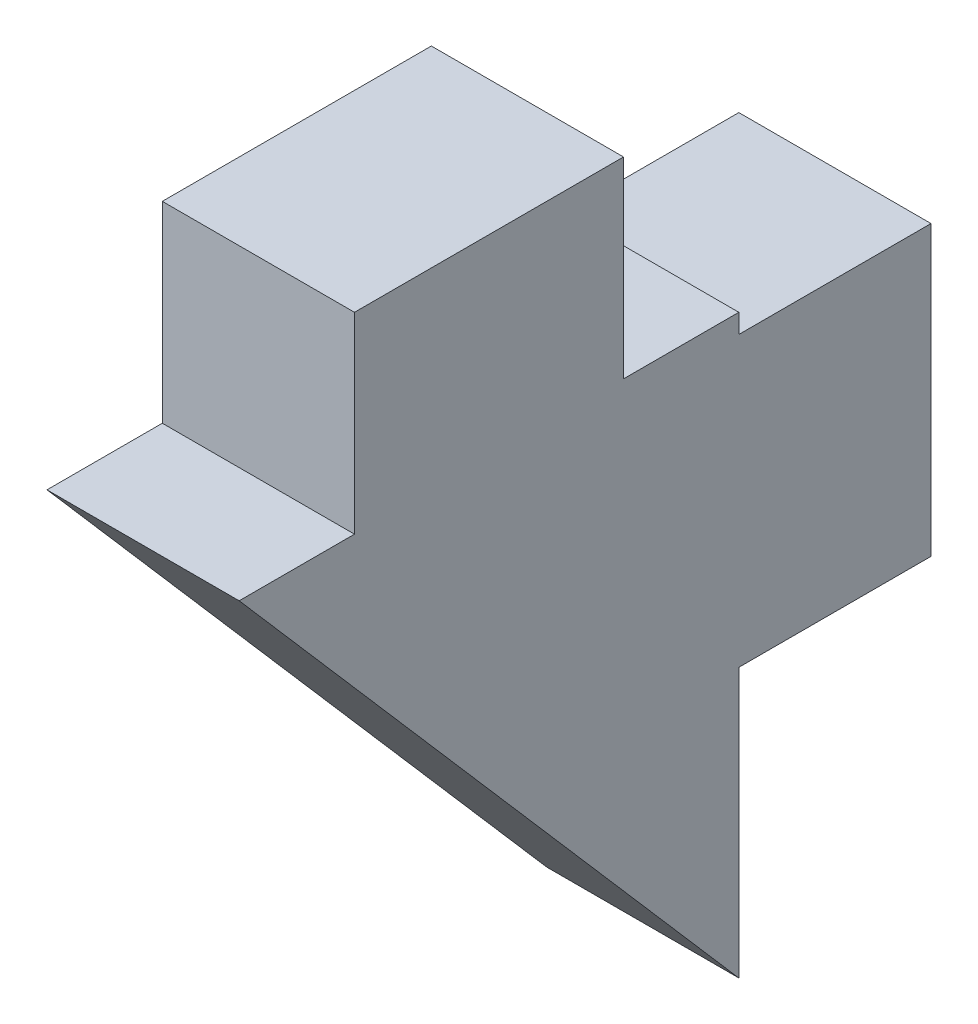
ISO-10303-21;
HEADER;
FILE_DESCRIPTION(('STEP AP214'),'2;1');
FILE_NAME('part.step','',(''),(''),'','','');
FILE_SCHEMA(('AUTOMOTIVE_DESIGN { 1 0 10303 214 1 1 1 1 }'));
ENDSEC;
DATA;
#1=APPLICATION_CONTEXT('core data for automotive mechanical design processes');
#2=APPLICATION_PROTOCOL_DEFINITION('international standard','automotive_design',2000,#1);
#3=PRODUCT_CONTEXT('',#1,'mechanical');
#4=PRODUCT('Part','Part','',(#3));
#5=PRODUCT_RELATED_PRODUCT_CATEGORY('part','',(#4));
#6=PRODUCT_DEFINITION_FORMATION('','',#4);
#7=PRODUCT_DEFINITION_CONTEXT('part definition',#1,'design');
#8=PRODUCT_DEFINITION('design','',#6,#7);
#9=PRODUCT_DEFINITION_SHAPE('','',#8);
#10=(LENGTH_UNIT() NAMED_UNIT(*) SI_UNIT(.MILLI.,.METRE.));
#11=(NAMED_UNIT(*) PLANE_ANGLE_UNIT() SI_UNIT($,.RADIAN.));
#12=(NAMED_UNIT(*) SI_UNIT($,.STERADIAN.) SOLID_ANGLE_UNIT());
#13=UNCERTAINTY_MEASURE_WITH_UNIT(LENGTH_MEASURE(1.E-05),#10,'distance_accuracy_value','');
#14=(GEOMETRIC_REPRESENTATION_CONTEXT(3) GLOBAL_UNCERTAINTY_ASSIGNED_CONTEXT((#13)) GLOBAL_UNIT_ASSIGNED_CONTEXT((#10,
#11,#12)) REPRESENTATION_CONTEXT('',''));
#15=CARTESIAN_POINT('',(0.,0.,0.));
#16=DIRECTION('',(0.,0.,1.));
#17=DIRECTION('',(1.,0.,0.));
#18=AXIS2_PLACEMENT_3D('',#15,#16,#17);
#19=CARTESIAN_POINT('',(5.,23.6913964310372,0.));
#20=DIRECTION('',(0.,0.,1.));
#21=DIRECTION('',(0.,-1.,0.));
#22=AXIS2_PLACEMENT_3D('',#19,#20,#21);
#23=PLANE('',#22);
#24=DIRECTION('',(0.,1.,0.));
#25=VECTOR('',#24,1.);
#26=CARTESIAN_POINT('',(0.,23.6913964310372,0.));
#27=LINE('',#26,#25);
#28=CARTESIAN_POINT('',(0.,16.6913964310372,0.));
#29=VERTEX_POINT('',#28);
#30=CARTESIAN_POINT('',(0.,23.6913964310372,0.));
#31=VERTEX_POINT('',#30);
#32=EDGE_CURVE('E148',#29,#31,#27,.T.);
#33=ORIENTED_EDGE('',*,*,#32,.T.);
#34=DIRECTION('',(-1.,0.,0.));
#35=VECTOR('',#34,1.);
#36=CARTESIAN_POINT('',(5.,23.6913964310372,0.));
#37=LINE('',#36,#35);
#38=CARTESIAN_POINT('',(5.,23.6913964310372,0.));
#39=VERTEX_POINT('',#38);
#40=EDGE_CURVE('E11',#39,#31,#37,.T.);
#41=ORIENTED_EDGE('',*,*,#40,.F.);
#42=DIRECTION('',(0.,1.,0.));
#43=VECTOR('',#42,1.);
#44=CARTESIAN_POINT('',(5.,23.6913964310372,0.));
#45=LINE('',#44,#43);
#46=CARTESIAN_POINT('',(5.,16.6913964310372,0.));
#47=VERTEX_POINT('',#46);
#48=EDGE_CURVE('E168',#47,#39,#45,.T.);
#49=ORIENTED_EDGE('',*,*,#48,.F.);
#50=DIRECTION('',(-1.,0.,0.));
#51=VECTOR('',#50,1.);
#52=CARTESIAN_POINT('',(5.,16.6913964310372,0.));
#53=LINE('',#52,#51);
#54=EDGE_CURVE('E144',#47,#29,#53,.T.);
#55=ORIENTED_EDGE('',*,*,#54,.T.);
#56=EDGE_LOOP('',(#33,#41,#49,#55));
#57=FACE_BOUND('',#56,.T.);
#58=ADVANCED_FACE('F34',(#57),#23,.F.);
#59=CARTESIAN_POINT('',(5.,23.6913964310372,0.));
#60=DIRECTION('',(0.,1.,0.));
#61=DIRECTION('',(0.,0.,1.));
#62=AXIS2_PLACEMENT_3D('',#59,#60,#61);
#63=PLANE('',#62);
#64=DIRECTION('',(0.,0.,-1.));
#65=VECTOR('',#64,1.);
#66=CARTESIAN_POINT('',(0.,23.6913964310372,0.));
#67=LINE('',#66,#65);
#68=CARTESIAN_POINT('',(0.,23.6913964310372,-5.));
#69=VERTEX_POINT('',#68);
#70=EDGE_CURVE('E151',#31,#69,#67,.T.);
#71=ORIENTED_EDGE('',*,*,#70,.T.);
#72=DIRECTION('',(-1.,0.,0.));
#73=VECTOR('',#72,1.);
#74=CARTESIAN_POINT('',(5.,23.6913964310372,-5.));
#75=LINE('',#74,#73);
#76=CARTESIAN_POINT('',(5.,23.6913964310372,-5.));
#77=VERTEX_POINT('',#76);
#78=EDGE_CURVE('E42',#77,#69,#75,.T.);
#79=ORIENTED_EDGE('',*,*,#78,.F.);
#80=DIRECTION('',(0.,0.,-1.));
#81=VECTOR('',#80,1.);
#82=CARTESIAN_POINT('',(5.,23.6913964310372,0.));
#83=LINE('',#82,#81);
#84=EDGE_CURVE('E102',#39,#77,#83,.T.);
#85=ORIENTED_EDGE('',*,*,#84,.F.);
#86=ORIENTED_EDGE('',*,*,#40,.T.);
#87=EDGE_LOOP('',(#71,#79,#85,#86));
#88=FACE_BOUND('',#87,.T.);
#89=ADVANCED_FACE('F240',(#88),#63,.F.);
#90=CARTESIAN_POINT('',(5.,31.1913964310372,-5.));
#91=DIRECTION('',(0.,0.,1.));
#92=DIRECTION('',(1.,0.,0.));
#93=AXIS2_PLACEMENT_3D('',#90,#91,#92);
#94=PLANE('',#93);
#95=DIRECTION('',(0.,1.,0.));
#96=VECTOR('',#95,1.);
#97=CARTESIAN_POINT('',(0.,31.1913964310372,-5.));
#98=LINE('',#97,#96);
#99=CARTESIAN_POINT('',(0.,31.1913964310372,-5.));
#100=VERTEX_POINT('',#99);
#101=EDGE_CURVE('E153',#69,#100,#98,.T.);
#102=ORIENTED_EDGE('',*,*,#101,.T.);
#103=DIRECTION('',(-1.,0.,0.));
#104=VECTOR('',#103,1.);
#105=CARTESIAN_POINT('',(5.,31.1913964310372,-5.));
#106=LINE('',#105,#104);
#107=CARTESIAN_POINT('',(5.,31.1913964310372,-5.));
#108=VERTEX_POINT('',#107);
#109=EDGE_CURVE('E184',#108,#100,#106,.T.);
#110=ORIENTED_EDGE('',*,*,#109,.F.);
#111=DIRECTION('',(0.,1.,0.));
#112=VECTOR('',#111,1.);
#113=CARTESIAN_POINT('',(5.,31.1913964310372,-5.));
#114=LINE('',#113,#112);
#115=EDGE_CURVE('E192',#77,#108,#114,.T.);
#116=ORIENTED_EDGE('',*,*,#115,.F.);
#117=ORIENTED_EDGE('',*,*,#78,.T.);
#118=EDGE_LOOP('',(#102,#110,#116,#117));
#119=FACE_BOUND('',#118,.T.);
#120=ADVANCED_FACE('F190',(#119),#94,.F.);
#121=CARTESIAN_POINT('',(5.,31.1913964310372,0.));
#122=DIRECTION('',(0.,-1.,0.));
#123=DIRECTION('',(0.,0.,-1.));
#124=AXIS2_PLACEMENT_3D('',#121,#122,#123);
#125=PLANE('',#124);
#126=DIRECTION('',(0.,0.,1.));
#127=VECTOR('',#126,1.);
#128=CARTESIAN_POINT('',(0.,31.1913964310372,0.));
#129=LINE('',#128,#127);
#130=CARTESIAN_POINT('',(0.,31.1913964310372,0.));
#131=VERTEX_POINT('',#130);
#132=EDGE_CURVE('E155',#100,#131,#129,.T.);
#133=ORIENTED_EDGE('',*,*,#132,.T.);
#134=DIRECTION('',(-1.,0.,0.));
#135=VECTOR('',#134,1.);
#136=CARTESIAN_POINT('',(5.,31.1913964310372,0.));
#137=LINE('',#136,#135);
#138=CARTESIAN_POINT('',(5.,31.1913964310372,0.));
#139=VERTEX_POINT('',#138);
#140=EDGE_CURVE('E181',#139,#131,#137,.T.);
#141=ORIENTED_EDGE('',*,*,#140,.F.);
#142=DIRECTION('',(0.,0.,1.));
#143=VECTOR('',#142,1.);
#144=CARTESIAN_POINT('',(5.,31.1913964310372,0.));
#145=LINE('',#144,#143);
#146=EDGE_CURVE('E210',#108,#139,#145,.T.);
#147=ORIENTED_EDGE('',*,*,#146,.F.);
#148=ORIENTED_EDGE('',*,*,#109,.T.);
#149=EDGE_LOOP('',(#133,#141,#147,#148));
#150=FACE_BOUND('',#149,.T.);
#151=ADVANCED_FACE('F201',(#150),#125,.F.);
#152=CARTESIAN_POINT('',(5.,31.1913964310372,0.));
#153=DIRECTION('',(0.,0.,1.));
#154=DIRECTION('',(0.,-1.,0.));
#155=AXIS2_PLACEMENT_3D('',#152,#153,#154);
#156=PLANE('',#155);
#157=DIRECTION('',(0.,1.,0.));
#158=VECTOR('',#157,1.);
#159=CARTESIAN_POINT('',(0.,31.1913964310372,0.));
#160=LINE('',#159,#158);
#161=CARTESIAN_POINT('',(0.,31.6913964310372,0.));
#162=VERTEX_POINT('',#161);
#163=EDGE_CURVE('E157',#131,#162,#160,.T.);
#164=ORIENTED_EDGE('',*,*,#163,.T.);
#165=DIRECTION('',(-1.,0.,0.));
#166=VECTOR('',#165,1.);
#167=CARTESIAN_POINT('',(5.,31.6913964310372,0.));
#168=LINE('',#167,#166);
#169=CARTESIAN_POINT('',(5.,31.6913964310372,0.));
#170=VERTEX_POINT('',#169);
#171=EDGE_CURVE('E178',#170,#162,#168,.T.);
#172=ORIENTED_EDGE('',*,*,#171,.F.);
#173=DIRECTION('',(0.,1.,0.));
#174=VECTOR('',#173,1.);
#175=CARTESIAN_POINT('',(5.,31.1913964310372,0.));
#176=LINE('',#175,#174);
#177=EDGE_CURVE('E207',#139,#170,#176,.T.);
#178=ORIENTED_EDGE('',*,*,#177,.F.);
#179=ORIENTED_EDGE('',*,*,#140,.T.);
#180=EDGE_LOOP('',(#164,#172,#178,#179));
#181=FACE_BOUND('',#180,.T.);
#182=ADVANCED_FACE('F205',(#181),#156,.F.);
#183=CARTESIAN_POINT('',(5.,31.6913964310372,0.));
#184=DIRECTION('',(0.,-1.,0.));
#185=DIRECTION('',(0.,0.,-1.));
#186=AXIS2_PLACEMENT_3D('',#183,#184,#185);
#187=PLANE('',#186);
#188=DIRECTION('',(0.,0.,1.));
#189=VECTOR('',#188,1.);
#190=CARTESIAN_POINT('',(0.,31.6913964310372,0.));
#191=LINE('',#190,#189);
#192=CARTESIAN_POINT('',(0.,31.6913964310372,3.));
#193=VERTEX_POINT('',#192);
#194=EDGE_CURVE('E159',#162,#193,#191,.T.);
#195=ORIENTED_EDGE('',*,*,#194,.T.);
#196=DIRECTION('',(-1.,0.,0.));
#197=VECTOR('',#196,1.);
#198=CARTESIAN_POINT('',(5.,31.6913964310372,3.));
#199=LINE('',#198,#197);
#200=CARTESIAN_POINT('',(5.,31.6913964310372,3.));
#201=VERTEX_POINT('',#200);
#202=EDGE_CURVE('E175',#201,#193,#199,.T.);
#203=ORIENTED_EDGE('',*,*,#202,.F.);
#204=DIRECTION('',(0.,0.,1.));
#205=VECTOR('',#204,1.);
#206=CARTESIAN_POINT('',(5.,31.6913964310372,0.));
#207=LINE('',#206,#205);
#208=EDGE_CURVE('E209',#170,#201,#207,.T.);
#209=ORIENTED_EDGE('',*,*,#208,.F.);
#210=ORIENTED_EDGE('',*,*,#171,.T.);
#211=EDGE_LOOP('',(#195,#203,#209,#210));
#212=FACE_BOUND('',#211,.T.);
#213=ADVANCED_FACE('F253',(#212),#187,.F.);
#214=CARTESIAN_POINT('',(5.,31.6913964310372,3.));
#215=DIRECTION('',(0.,0.,1.));
#216=DIRECTION('',(1.,0.,0.));
#217=AXIS2_PLACEMENT_3D('',#214,#215,#216);
#218=PLANE('',#217);
#219=DIRECTION('',(0.,1.,0.));
#220=VECTOR('',#219,1.);
#221=CARTESIAN_POINT('',(0.,31.6913964310372,3.));
#222=LINE('',#221,#220);
#223=CARTESIAN_POINT('',(0.,36.6913964310372,3.));
#224=VERTEX_POINT('',#223);
#225=EDGE_CURVE('E161',#193,#224,#222,.T.);
#226=ORIENTED_EDGE('',*,*,#225,.T.);
#227=DIRECTION('',(-1.,0.,0.));
#228=VECTOR('',#227,1.);
#229=CARTESIAN_POINT('',(5.,36.6913964310372,3.));
#230=LINE('',#229,#228);
#231=CARTESIAN_POINT('',(5.,36.6913964310372,3.));
#232=VERTEX_POINT('',#231);
#233=EDGE_CURVE('E172',#232,#224,#230,.T.);
#234=ORIENTED_EDGE('',*,*,#233,.F.);
#235=DIRECTION('',(0.,1.,0.));
#236=VECTOR('',#235,1.);
#237=CARTESIAN_POINT('',(5.,31.6913964310372,3.));
#238=LINE('',#237,#236);
#239=EDGE_CURVE('E212',#201,#232,#238,.T.);
#240=ORIENTED_EDGE('',*,*,#239,.F.);
#241=ORIENTED_EDGE('',*,*,#202,.T.);
#242=EDGE_LOOP('',(#226,#234,#240,#241));
#243=FACE_BOUND('',#242,.T.);
#244=ADVANCED_FACE('F221',(#243),#218,.F.);
#245=CARTESIAN_POINT('',(5.,36.6913964310372,3.));
#246=DIRECTION('',(0.,-1.,0.));
#247=DIRECTION('',(0.,0.,-1.));
#248=AXIS2_PLACEMENT_3D('',#245,#246,#247);
#249=PLANE('',#248);
#250=DIRECTION('',(0.,0.,1.));
#251=VECTOR('',#250,1.);
#252=CARTESIAN_POINT('',(0.,36.6913964310372,3.));
#253=LINE('',#252,#251);
#254=CARTESIAN_POINT('',(0.,36.6913964310372,10.));
#255=VERTEX_POINT('',#254);
#256=EDGE_CURVE('E163',#224,#255,#253,.T.);
#257=ORIENTED_EDGE('',*,*,#256,.T.);
#258=DIRECTION('',(-1.,0.,0.));
#259=VECTOR('',#258,1.);
#260=CARTESIAN_POINT('',(5.,36.6913964310372,10.));
#261=LINE('',#260,#259);
#262=CARTESIAN_POINT('',(5.,36.6913964310372,10.));
#263=VERTEX_POINT('',#262);
#264=EDGE_CURVE('E139',#263,#255,#261,.T.);
#265=ORIENTED_EDGE('',*,*,#264,.F.);
#266=DIRECTION('',(0.,0.,1.));
#267=VECTOR('',#266,1.);
#268=CARTESIAN_POINT('',(5.,36.6913964310372,3.));
#269=LINE('',#268,#267);
#270=EDGE_CURVE('E130',#232,#263,#269,.T.);
#271=ORIENTED_EDGE('',*,*,#270,.F.);
#272=ORIENTED_EDGE('',*,*,#233,.T.);
#273=EDGE_LOOP('',(#257,#265,#271,#272));
#274=FACE_BOUND('',#273,.T.);
#275=ADVANCED_FACE('F225',(#274),#249,.F.);
#276=CARTESIAN_POINT('',(5.,31.6913964310372,10.));
#277=DIRECTION('',(0.,0.,-1.));
#278=DIRECTION('',(-1.,0.,0.));
#279=AXIS2_PLACEMENT_3D('',#276,#277,#278);
#280=PLANE('',#279);
#281=DIRECTION('',(0.,-1.,0.));
#282=VECTOR('',#281,1.);
#283=CARTESIAN_POINT('',(0.,31.6913964310372,10.));
#284=LINE('',#283,#282);
#285=CARTESIAN_POINT('',(0.,31.6913964310372,10.));
#286=VERTEX_POINT('',#285);
#287=EDGE_CURVE('E138',#255,#286,#284,.T.);
#288=ORIENTED_EDGE('',*,*,#287,.T.);
#289=DIRECTION('',(-1.,0.,0.));
#290=VECTOR('',#289,1.);
#291=CARTESIAN_POINT('',(5.,31.6913964310372,10.));
#292=LINE('',#291,#290);
#293=CARTESIAN_POINT('',(5.,31.6913964310372,10.));
#294=VERTEX_POINT('',#293);
#295=EDGE_CURVE('E135',#294,#286,#292,.T.);
#296=ORIENTED_EDGE('',*,*,#295,.F.);
#297=DIRECTION('',(0.,-1.,0.));
#298=VECTOR('',#297,1.);
#299=CARTESIAN_POINT('',(5.,31.6913964310372,10.));
#300=LINE('',#299,#298);
#301=EDGE_CURVE('E124',#263,#294,#300,.T.);
#302=ORIENTED_EDGE('',*,*,#301,.F.);
#303=ORIENTED_EDGE('',*,*,#264,.T.);
#304=EDGE_LOOP('',(#288,#296,#302,#303));
#305=FACE_BOUND('',#304,.T.);
#306=ADVANCED_FACE('F136',(#305),#280,.F.);
#307=CARTESIAN_POINT('',(5.,31.6913964310372,10.));
#308=DIRECTION('',(0.,-1.,0.));
#309=DIRECTION('',(0.,0.,-1.));
#310=AXIS2_PLACEMENT_3D('',#307,#308,#309);
#311=PLANE('',#310);
#312=DIRECTION('',(0.,0.,1.));
#313=VECTOR('',#312,1.);
#314=CARTESIAN_POINT('',(0.,31.6913964310372,10.));
#315=LINE('',#314,#313);
#316=CARTESIAN_POINT('',(0.,31.6913964310372,13.));
#317=VERTEX_POINT('',#316);
#318=EDGE_CURVE('E88',#286,#317,#315,.T.);
#319=ORIENTED_EDGE('',*,*,#318,.T.);
#320=DIRECTION('',(-1.,0.,0.));
#321=VECTOR('',#320,1.);
#322=CARTESIAN_POINT('',(5.,31.6913964310372,13.));
#323=LINE('',#322,#321);
#324=CARTESIAN_POINT('',(5.,31.6913964310372,13.));
#325=VERTEX_POINT('',#324);
#326=EDGE_CURVE('E140',#325,#317,#323,.T.);
#327=ORIENTED_EDGE('',*,*,#326,.F.);
#328=DIRECTION('',(0.,0.,1.));
#329=VECTOR('',#328,1.);
#330=CARTESIAN_POINT('',(5.,31.6913964310372,10.));
#331=LINE('',#330,#329);
#332=EDGE_CURVE('E128',#294,#325,#331,.T.);
#333=ORIENTED_EDGE('',*,*,#332,.F.);
#334=ORIENTED_EDGE('',*,*,#295,.T.);
#335=EDGE_LOOP('',(#319,#327,#333,#334));
#336=FACE_BOUND('',#335,.T.);
#337=ADVANCED_FACE('F142',(#336),#311,.F.);
#338=CARTESIAN_POINT('',(5.,31.6913964310372,13.));
#339=DIRECTION('',(0.,0.654930538417842,-0.755689082789817));
#340=DIRECTION('',(0.,0.755689082789817,0.654930538417842));
#341=AXIS2_PLACEMENT_3D('',#338,#339,#340);
#342=PLANE('',#341);
#343=DIRECTION('',(0.,-0.755689082789817,-0.654930538417842));
#344=VECTOR('',#343,1.);
#345=CARTESIAN_POINT('',(0.,31.6913964310372,13.));
#346=LINE('',#345,#344);
#347=EDGE_CURVE('E94',#317,#29,#346,.T.);
#348=ORIENTED_EDGE('',*,*,#347,.T.);
#349=ORIENTED_EDGE('',*,*,#54,.F.);
#350=DIRECTION('',(0.,-0.755689082789817,-0.654930538417842));
#351=VECTOR('',#350,1.);
#352=CARTESIAN_POINT('',(5.,31.6913964310372,13.));
#353=LINE('',#352,#351);
#354=EDGE_CURVE('E50',#325,#47,#353,.T.);
#355=ORIENTED_EDGE('',*,*,#354,.F.);
#356=ORIENTED_EDGE('',*,*,#326,.T.);
#357=EDGE_LOOP('',(#348,#349,#355,#356));
#358=FACE_BOUND('',#357,.T.);
#359=ADVANCED_FACE('F229',(#358),#342,.F.);
#360=CARTESIAN_POINT('',(5.,0.,0.));
#361=DIRECTION('',(-1.,0.,0.));
#362=DIRECTION('',(0.,0.,1.));
#363=AXIS2_PLACEMENT_3D('',#360,#361,#362);
#364=PLANE('',#363);
#365=ORIENTED_EDGE('',*,*,#48,.T.);
#366=ORIENTED_EDGE('',*,*,#84,.T.);
#367=ORIENTED_EDGE('',*,*,#115,.T.);
#368=ORIENTED_EDGE('',*,*,#146,.T.);
#369=ORIENTED_EDGE('',*,*,#177,.T.);
#370=ORIENTED_EDGE('',*,*,#208,.T.);
#371=ORIENTED_EDGE('',*,*,#239,.T.);
#372=ORIENTED_EDGE('',*,*,#270,.T.);
#373=ORIENTED_EDGE('',*,*,#301,.T.);
#374=ORIENTED_EDGE('',*,*,#332,.T.);
#375=ORIENTED_EDGE('',*,*,#354,.T.);
#376=EDGE_LOOP('',(#365,#366,#367,#368,#369,#370,#371,#372,#373,#374,#375));
#377=FACE_BOUND('',#376,.T.);
#378=ADVANCED_FACE('F126',(#377),#364,.F.);
#379=CARTESIAN_POINT('',(0.,0.,0.));
#380=DIRECTION('',(-1.,0.,0.));
#381=DIRECTION('',(0.,0.,1.));
#382=AXIS2_PLACEMENT_3D('',#379,#380,#381);
#383=PLANE('',#382);
#384=ORIENTED_EDGE('',*,*,#32,.F.);
#385=ORIENTED_EDGE('',*,*,#347,.F.);
#386=ORIENTED_EDGE('',*,*,#318,.F.);
#387=ORIENTED_EDGE('',*,*,#287,.F.);
#388=ORIENTED_EDGE('',*,*,#256,.F.);
#389=ORIENTED_EDGE('',*,*,#225,.F.);
#390=ORIENTED_EDGE('',*,*,#194,.F.);
#391=ORIENTED_EDGE('',*,*,#163,.F.);
#392=ORIENTED_EDGE('',*,*,#132,.F.);
#393=ORIENTED_EDGE('',*,*,#101,.F.);
#394=ORIENTED_EDGE('',*,*,#70,.F.);
#395=EDGE_LOOP('',(#384,#385,#386,#387,#388,#389,#390,#391,#392,#393,#394));
#396=FACE_BOUND('',#395,.T.);
#397=ADVANCED_FACE('F196',(#396),#383,.T.);
#398=CLOSED_SHELL('',(#58,#89,#120,#151,#182,#213,#244,#275,#306,#337,#359,#378,#397));
#399=MANIFOLD_SOLID_BREP('B2',#398);
#400=ADVANCED_BREP_SHAPE_REPRESENTATION('',(#18,#399),#14);
#401=SHAPE_DEFINITION_REPRESENTATION(#9,#400);
ENDSEC;
END-ISO-10303-21;
